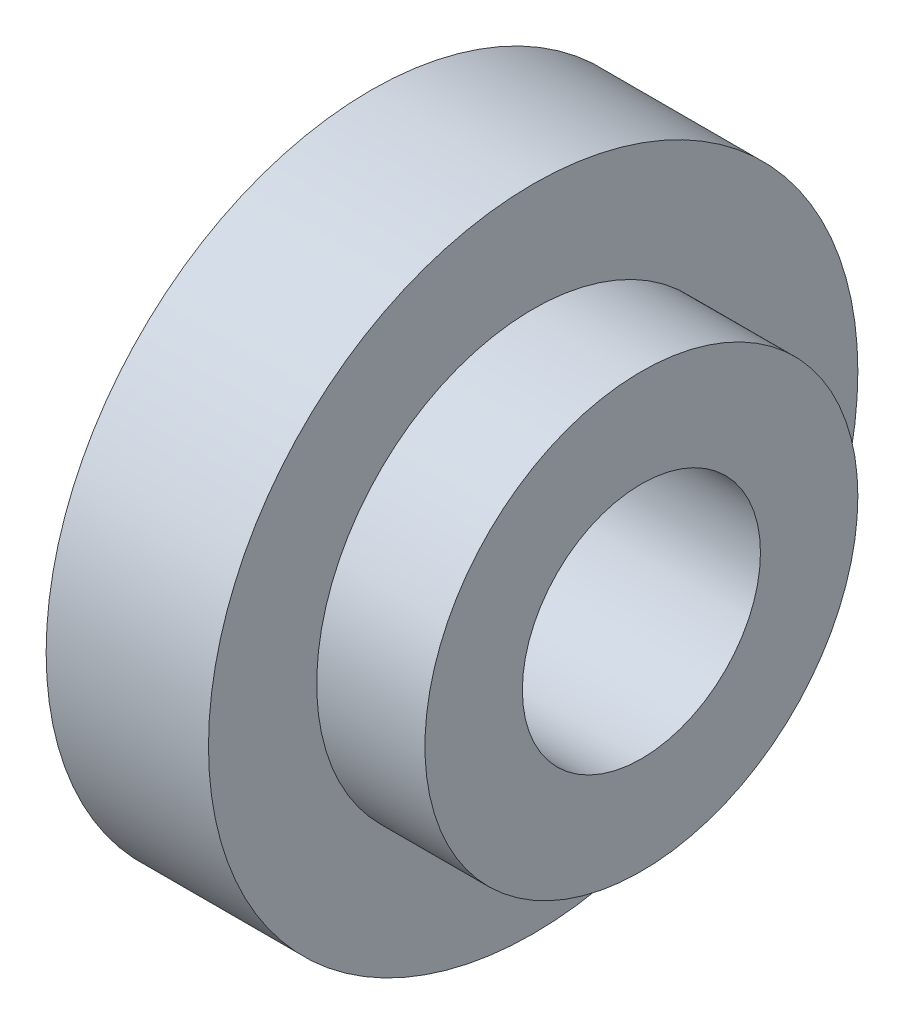
ISO-10303-21;
HEADER;
FILE_DESCRIPTION(('STEP AP214'),'2;1');
FILE_NAME('part.step','',(''),(''),'','','');
FILE_SCHEMA(('AUTOMOTIVE_DESIGN { 1 0 10303 214 1 1 1 1 }'));
ENDSEC;
DATA;
#1=APPLICATION_CONTEXT('core data for automotive mechanical design processes');
#2=APPLICATION_PROTOCOL_DEFINITION('international standard','automotive_design',2000,#1);
#3=PRODUCT_CONTEXT('',#1,'mechanical');
#4=PRODUCT('Part','Part','',(#3));
#5=PRODUCT_RELATED_PRODUCT_CATEGORY('part','',(#4));
#6=PRODUCT_DEFINITION_FORMATION('','',#4);
#7=PRODUCT_DEFINITION_CONTEXT('part definition',#1,'design');
#8=PRODUCT_DEFINITION('design','',#6,#7);
#9=PRODUCT_DEFINITION_SHAPE('','',#8);
#10=(LENGTH_UNIT() NAMED_UNIT(*) SI_UNIT(.MILLI.,.METRE.));
#11=(NAMED_UNIT(*) PLANE_ANGLE_UNIT() SI_UNIT($,.RADIAN.));
#12=(NAMED_UNIT(*) SI_UNIT($,.STERADIAN.) SOLID_ANGLE_UNIT());
#13=UNCERTAINTY_MEASURE_WITH_UNIT(LENGTH_MEASURE(1.E-05),#10,'distance_accuracy_value','');
#14=(GEOMETRIC_REPRESENTATION_CONTEXT(3) GLOBAL_UNCERTAINTY_ASSIGNED_CONTEXT((#13)) GLOBAL_UNIT_ASSIGNED_CONTEXT((#10,
#11,#12)) REPRESENTATION_CONTEXT('',''));
#15=CARTESIAN_POINT('',(0.,0.,0.));
#16=DIRECTION('',(0.,0.,1.));
#17=DIRECTION('',(1.,0.,0.));
#18=AXIS2_PLACEMENT_3D('',#15,#16,#17);
#19=CARTESIAN_POINT('',(10.96784,200.770725930439,177.548409599509));
#20=DIRECTION('',(1.,0.,0.));
#21=DIRECTION('',(0.,0.,-1.));
#22=AXIS2_PLACEMENT_3D('',#19,#20,#21);
#23=PLANE('',#22);
#24=CARTESIAN_POINT('',(10.96784,198.770725930439,177.548409599509));
#25=DIRECTION('',(1.,0.,0.));
#26=DIRECTION('',(0.,0.,-1.));
#27=AXIS2_PLACEMENT_3D('',#24,#25,#26);
#28=CIRCLE('',#27,2.);
#29=CARTESIAN_POINT('',(10.96784,198.770725930439,175.548409599509));
#30=VERTEX_POINT('',#29);
#31=EDGE_CURVE('E55',#30,#30,#28,.T.);
#32=ORIENTED_EDGE('',*,*,#31,.T.);
#33=EDGE_LOOP('',(#32));
#34=FACE_BOUND('',#33,.T.);
#35=CARTESIAN_POINT('',(10.96784,198.770725930439,177.548409599509));
#36=DIRECTION('',(1.,0.,0.));
#37=DIRECTION('',(0.,0.,-1.));
#38=AXIS2_PLACEMENT_3D('',#35,#36,#37);
#39=CIRCLE('',#38,1.09999999999999);
#40=CARTESIAN_POINT('',(10.96784,198.770725930439,176.448409599509));
#41=VERTEX_POINT('',#40);
#42=EDGE_CURVE('E10',#41,#41,#39,.T.);
#43=ORIENTED_EDGE('',*,*,#42,.F.);
#44=EDGE_LOOP('',(#43));
#45=FACE_BOUND('',#44,.T.);
#46=ADVANCED_FACE('F33',(#34,#45),#23,.T.);
#47=CARTESIAN_POINT('',(10.24284,198.770725930439,177.548409599509));
#48=DIRECTION('',(1.,0.,0.));
#49=DIRECTION('',(0.,0.,-1.));
#50=AXIS2_PLACEMENT_3D('',#47,#48,#49);
#51=CYLINDRICAL_SURFACE('',#50,1.09999999999999);
#52=ORIENTED_EDGE('',*,*,#42,.T.);
#53=EDGE_LOOP('',(#52));
#54=FACE_BOUND('',#53,.T.);
#55=CARTESIAN_POINT('',(8.46784000000001,198.770725930439,177.548409599509));
#56=DIRECTION('',(1.,0.,0.));
#57=DIRECTION('',(0.,0.,-1.));
#58=AXIS2_PLACEMENT_3D('',#55,#56,#57);
#59=CIRCLE('',#58,1.09999999999999);
#60=CARTESIAN_POINT('',(8.46784000000001,198.770725930439,176.448409599509));
#61=VERTEX_POINT('',#60);
#62=EDGE_CURVE('E39',#61,#61,#59,.T.);
#63=ORIENTED_EDGE('',*,*,#62,.F.);
#64=EDGE_LOOP('',(#63));
#65=FACE_BOUND('',#64,.T.);
#66=ADVANCED_FACE('F73',(#54,#65),#51,.F.);
#67=CARTESIAN_POINT('',(8.46784000000001,199.870725930439,177.548409599509));
#68=DIRECTION('',(-1.,0.,0.));
#69=DIRECTION('',(0.,0.,1.));
#70=AXIS2_PLACEMENT_3D('',#67,#68,#69);
#71=PLANE('',#70);
#72=ORIENTED_EDGE('',*,*,#62,.T.);
#73=EDGE_LOOP('',(#72));
#74=FACE_BOUND('',#73,.T.);
#75=CARTESIAN_POINT('',(8.46784000000001,198.770725930439,177.548409599509));
#76=DIRECTION('',(1.,0.,0.));
#77=DIRECTION('',(0.,0.,-1.));
#78=AXIS2_PLACEMENT_3D('',#75,#76,#77);
#79=CIRCLE('',#78,3.);
#80=CARTESIAN_POINT('',(8.46784000000001,198.770725930439,174.548409599509));
#81=VERTEX_POINT('',#80);
#82=EDGE_CURVE('E43',#81,#81,#79,.T.);
#83=ORIENTED_EDGE('',*,*,#82,.F.);
#84=EDGE_LOOP('',(#83));
#85=FACE_BOUND('',#84,.T.);
#86=ADVANCED_FACE('F77',(#74,#85),#71,.T.);
#87=CARTESIAN_POINT('',(10.24284,198.770725930439,177.548409599509));
#88=DIRECTION('',(1.,0.,0.));
#89=DIRECTION('',(0.,0.,-1.));
#90=AXIS2_PLACEMENT_3D('',#87,#88,#89);
#91=CYLINDRICAL_SURFACE('',#90,3.);
#92=ORIENTED_EDGE('',*,*,#82,.T.);
#93=EDGE_LOOP('',(#92));
#94=FACE_BOUND('',#93,.T.);
#95=CARTESIAN_POINT('',(9.96784000000001,198.770725930439,177.548409599509));
#96=DIRECTION('',(1.,0.,0.));
#97=DIRECTION('',(0.,0.,-1.));
#98=AXIS2_PLACEMENT_3D('',#95,#96,#97);
#99=CIRCLE('',#98,3.);
#100=CARTESIAN_POINT('',(9.96784000000001,198.770725930439,174.548409599509));
#101=VERTEX_POINT('',#100);
#102=EDGE_CURVE('E47',#101,#101,#99,.T.);
#103=ORIENTED_EDGE('',*,*,#102,.F.);
#104=EDGE_LOOP('',(#103));
#105=FACE_BOUND('',#104,.T.);
#106=ADVANCED_FACE('F69',(#94,#105),#91,.T.);
#107=CARTESIAN_POINT('',(9.96784000000001,201.770725930439,177.548409599509));
#108=DIRECTION('',(1.,0.,0.));
#109=DIRECTION('',(0.,0.,-1.));
#110=AXIS2_PLACEMENT_3D('',#107,#108,#109);
#111=PLANE('',#110);
#112=ORIENTED_EDGE('',*,*,#102,.T.);
#113=EDGE_LOOP('',(#112));
#114=FACE_BOUND('',#113,.T.);
#115=CARTESIAN_POINT('',(9.96784000000001,198.770725930439,177.548409599509));
#116=DIRECTION('',(1.,0.,0.));
#117=DIRECTION('',(0.,0.,-1.));
#118=AXIS2_PLACEMENT_3D('',#115,#116,#117);
#119=CIRCLE('',#118,2.);
#120=CARTESIAN_POINT('',(9.96784000000001,198.770725930439,175.548409599509));
#121=VERTEX_POINT('',#120);
#122=EDGE_CURVE('E52',#121,#121,#119,.T.);
#123=ORIENTED_EDGE('',*,*,#122,.F.);
#124=EDGE_LOOP('',(#123));
#125=FACE_BOUND('',#124,.T.);
#126=ADVANCED_FACE('F63',(#114,#125),#111,.T.);
#127=CARTESIAN_POINT('',(10.24284,198.770725930439,177.548409599509));
#128=DIRECTION('',(1.,0.,0.));
#129=DIRECTION('',(0.,0.,-1.));
#130=AXIS2_PLACEMENT_3D('',#127,#128,#129);
#131=CYLINDRICAL_SURFACE('',#130,2.);
#132=ORIENTED_EDGE('',*,*,#122,.T.);
#133=EDGE_LOOP('',(#132));
#134=FACE_BOUND('',#133,.T.);
#135=ORIENTED_EDGE('',*,*,#31,.F.);
#136=EDGE_LOOP('',(#135));
#137=FACE_BOUND('',#136,.T.);
#138=ADVANCED_FACE('F61',(#134,#137),#131,.T.);
#139=CLOSED_SHELL('',(#46,#66,#86,#106,#126,#138));
#140=MANIFOLD_SOLID_BREP('B2',#139);
#141=ADVANCED_BREP_SHAPE_REPRESENTATION('',(#18,#140),#14);
#142=SHAPE_DEFINITION_REPRESENTATION(#9,#141);
ENDSEC;
END-ISO-10303-21;
